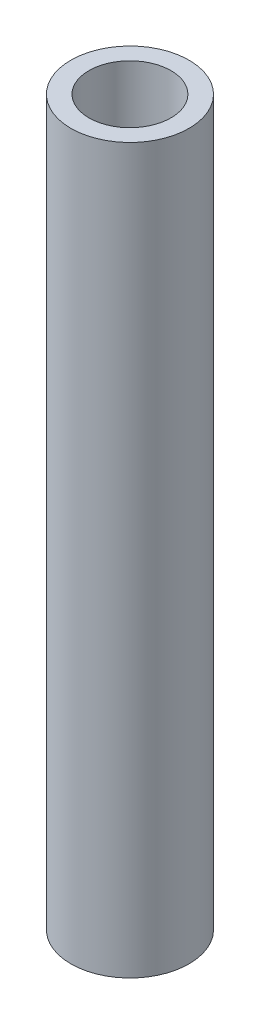
ISO-10303-21;
HEADER;
FILE_DESCRIPTION(('STEP AP214'),'2;1');
FILE_NAME('part.step','',(''),(''),'','','');
FILE_SCHEMA(('AUTOMOTIVE_DESIGN { 1 0 10303 214 1 1 1 1 }'));
ENDSEC;
DATA;
#1=APPLICATION_CONTEXT('core data for automotive mechanical design processes');
#2=APPLICATION_PROTOCOL_DEFINITION('international standard','automotive_design',2000,#1);
#3=PRODUCT_CONTEXT('',#1,'mechanical');
#4=PRODUCT('Part','Part','',(#3));
#5=PRODUCT_RELATED_PRODUCT_CATEGORY('part','',(#4));
#6=PRODUCT_DEFINITION_FORMATION('','',#4);
#7=PRODUCT_DEFINITION_CONTEXT('part definition',#1,'design');
#8=PRODUCT_DEFINITION('design','',#6,#7);
#9=PRODUCT_DEFINITION_SHAPE('','',#8);
#10=(LENGTH_UNIT() NAMED_UNIT(*) SI_UNIT(.MILLI.,.METRE.));
#11=(NAMED_UNIT(*) PLANE_ANGLE_UNIT() SI_UNIT($,.RADIAN.));
#12=(NAMED_UNIT(*) SI_UNIT($,.STERADIAN.) SOLID_ANGLE_UNIT());
#13=UNCERTAINTY_MEASURE_WITH_UNIT(LENGTH_MEASURE(1.E-05),#10,'distance_accuracy_value','');
#14=(GEOMETRIC_REPRESENTATION_CONTEXT(3) GLOBAL_UNCERTAINTY_ASSIGNED_CONTEXT((#13)) GLOBAL_UNIT_ASSIGNED_CONTEXT((#10,
#11,#12)) REPRESENTATION_CONTEXT('',''));
#15=CARTESIAN_POINT('',(0.,0.,0.));
#16=DIRECTION('',(0.,0.,1.));
#17=DIRECTION('',(1.,0.,0.));
#18=AXIS2_PLACEMENT_3D('',#15,#16,#17);
#19=CARTESIAN_POINT('',(0.,19.05,0.));
#20=DIRECTION('',(0.,1.,0.));
#21=DIRECTION('',(0.,0.,1.));
#22=AXIS2_PLACEMENT_3D('',#19,#20,#21);
#23=PLANE('',#22);
#24=CARTESIAN_POINT('',(0.,19.05,0.));
#25=DIRECTION('',(0.,1.,0.));
#26=DIRECTION('',(0.,0.,1.));
#27=AXIS2_PLACEMENT_3D('',#24,#25,#26);
#28=CIRCLE('',#27,3.1115);
#29=CARTESIAN_POINT('',(0.,19.05,3.1115));
#30=VERTEX_POINT('',#29);
#31=EDGE_CURVE('E10',#30,#30,#28,.T.);
#32=ORIENTED_EDGE('',*,*,#31,.T.);
#33=EDGE_LOOP('',(#32));
#34=FACE_BOUND('',#33,.T.);
#35=CARTESIAN_POINT('',(0.,19.05,0.));
#36=DIRECTION('',(0.,1.,0.));
#37=DIRECTION('',(0.,0.,1.));
#38=AXIS2_PLACEMENT_3D('',#35,#36,#37);
#39=CIRCLE('',#38,2.159);
#40=CARTESIAN_POINT('',(0.,19.05,2.159));
#41=VERTEX_POINT('',#40);
#42=EDGE_CURVE('E45',#41,#41,#39,.T.);
#43=ORIENTED_EDGE('',*,*,#42,.F.);
#44=EDGE_LOOP('',(#43));
#45=FACE_BOUND('',#44,.T.);
#46=ADVANCED_FACE('F34',(#34,#45),#23,.T.);
#47=CARTESIAN_POINT('',(0.,-19.05,0.));
#48=DIRECTION('',(0.,1.,0.));
#49=DIRECTION('',(0.,0.,1.));
#50=AXIS2_PLACEMENT_3D('',#47,#48,#49);
#51=PLANE('',#50);
#52=CARTESIAN_POINT('',(0.,-19.05,0.));
#53=DIRECTION('',(0.,1.,0.));
#54=DIRECTION('',(0.,0.,1.));
#55=AXIS2_PLACEMENT_3D('',#52,#53,#54);
#56=CIRCLE('',#55,3.1115);
#57=CARTESIAN_POINT('',(0.,-19.05,3.1115));
#58=VERTEX_POINT('',#57);
#59=EDGE_CURVE('E38',#58,#58,#56,.T.);
#60=ORIENTED_EDGE('',*,*,#59,.F.);
#61=EDGE_LOOP('',(#60));
#62=FACE_BOUND('',#61,.T.);
#63=CARTESIAN_POINT('',(0.,-19.05,0.));
#64=DIRECTION('',(0.,1.,0.));
#65=DIRECTION('',(0.,0.,1.));
#66=AXIS2_PLACEMENT_3D('',#63,#64,#65);
#67=CIRCLE('',#66,2.159);
#68=CARTESIAN_POINT('',(0.,-19.05,2.159));
#69=VERTEX_POINT('',#68);
#70=EDGE_CURVE('E47',#69,#69,#67,.T.);
#71=ORIENTED_EDGE('',*,*,#70,.T.);
#72=EDGE_LOOP('',(#71));
#73=FACE_BOUND('',#72,.T.);
#74=ADVANCED_FACE('F57',(#62,#73),#51,.F.);
#75=CARTESIAN_POINT('',(0.,19.05,0.));
#76=DIRECTION('',(0.,-1.,0.));
#77=DIRECTION('',(0.,0.,-1.));
#78=AXIS2_PLACEMENT_3D('',#75,#76,#77);
#79=CYLINDRICAL_SURFACE('',#78,3.1115);
#80=ORIENTED_EDGE('',*,*,#31,.F.);
#81=EDGE_LOOP('',(#80));
#82=FACE_BOUND('',#81,.T.);
#83=ORIENTED_EDGE('',*,*,#59,.T.);
#84=EDGE_LOOP('',(#83));
#85=FACE_BOUND('',#84,.T.);
#86=ADVANCED_FACE('F36',(#82,#85),#79,.T.);
#87=CARTESIAN_POINT('',(0.,19.05,0.));
#88=DIRECTION('',(0.,-1.,0.));
#89=DIRECTION('',(0.,0.,-1.));
#90=AXIS2_PLACEMENT_3D('',#87,#88,#89);
#91=CYLINDRICAL_SURFACE('',#90,2.159);
#92=ORIENTED_EDGE('',*,*,#42,.T.);
#93=EDGE_LOOP('',(#92));
#94=FACE_BOUND('',#93,.T.);
#95=ORIENTED_EDGE('',*,*,#70,.F.);
#96=EDGE_LOOP('',(#95));
#97=FACE_BOUND('',#96,.T.);
#98=ADVANCED_FACE('F53',(#94,#97),#91,.F.);
#99=CLOSED_SHELL('',(#46,#74,#86,#98));
#100=MANIFOLD_SOLID_BREP('B2',#99);
#101=ADVANCED_BREP_SHAPE_REPRESENTATION('',(#18,#100),#14);
#102=SHAPE_DEFINITION_REPRESENTATION(#9,#101);
ENDSEC;
END-ISO-10303-21;
